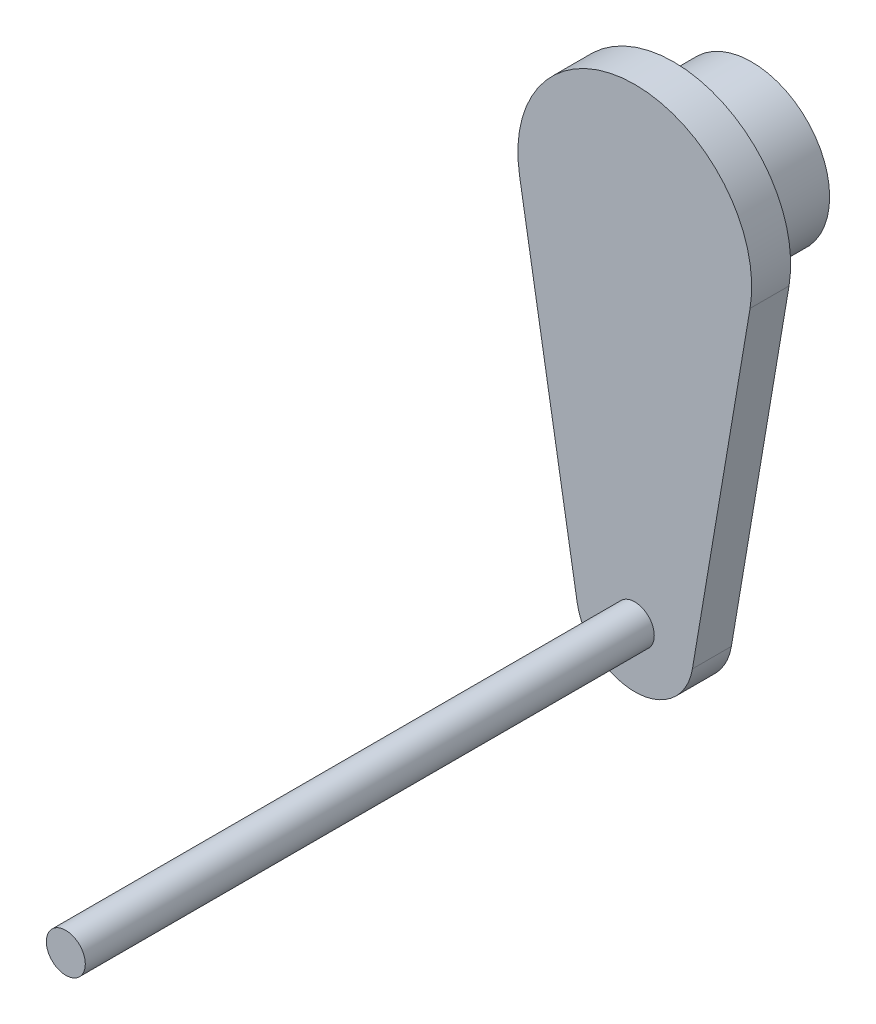
ISO-10303-21;
HEADER;
FILE_DESCRIPTION(('STEP AP214'),'2;1');
FILE_NAME('part.step','',(''),(''),'','','');
FILE_SCHEMA(('AUTOMOTIVE_DESIGN { 1 0 10303 214 1 1 1 1 }'));
ENDSEC;
DATA;
#1=APPLICATION_CONTEXT('core data for automotive mechanical design processes');
#2=APPLICATION_PROTOCOL_DEFINITION('international standard','automotive_design',2000,#1);
#3=PRODUCT_CONTEXT('',#1,'mechanical');
#4=PRODUCT('Part','Part','',(#3));
#5=PRODUCT_RELATED_PRODUCT_CATEGORY('part','',(#4));
#6=PRODUCT_DEFINITION_FORMATION('','',#4);
#7=PRODUCT_DEFINITION_CONTEXT('part definition',#1,'design');
#8=PRODUCT_DEFINITION('design','',#6,#7);
#9=PRODUCT_DEFINITION_SHAPE('','',#8);
#10=(LENGTH_UNIT() NAMED_UNIT(*) SI_UNIT(.MILLI.,.METRE.));
#11=(NAMED_UNIT(*) PLANE_ANGLE_UNIT() SI_UNIT($,.RADIAN.));
#12=(NAMED_UNIT(*) SI_UNIT($,.STERADIAN.) SOLID_ANGLE_UNIT());
#13=UNCERTAINTY_MEASURE_WITH_UNIT(LENGTH_MEASURE(1.E-05),#10,'distance_accuracy_value','');
#14=(GEOMETRIC_REPRESENTATION_CONTEXT(3) GLOBAL_UNCERTAINTY_ASSIGNED_CONTEXT((#13)) GLOBAL_UNIT_ASSIGNED_CONTEXT((#10,
#11,#12)) REPRESENTATION_CONTEXT('',''));
#15=CARTESIAN_POINT('',(0.,0.,0.));
#16=DIRECTION('',(0.,0.,1.));
#17=DIRECTION('',(1.,0.,0.));
#18=AXIS2_PLACEMENT_3D('',#15,#16,#17);
#19=CARTESIAN_POINT('',(0.,-1.22124532708767E-12,-48.6210244842766));
#20=DIRECTION('',(0.,0.,1.));
#21=DIRECTION('',(1.,0.,0.));
#22=AXIS2_PLACEMENT_3D('',#19,#20,#21);
#23=CYLINDRICAL_SURFACE('',#22,12.7);
#24=CARTESIAN_POINT('',(0.,-1.22124532708767E-12,-12.7));
#25=DIRECTION('',(0.,0.,1.));
#26=DIRECTION('',(1.,0.,0.));
#27=AXIS2_PLACEMENT_3D('',#24,#25,#26);
#28=CIRCLE('',#27,12.7);
#29=CARTESIAN_POINT('',(12.7,-1.22124532708767E-12,-12.7));
#30=VERTEX_POINT('',#29);
#31=EDGE_CURVE('E12',#30,#30,#28,.F.);
#32=ORIENTED_EDGE('',*,*,#31,.F.);
#33=EDGE_LOOP('',(#32));
#34=FACE_BOUND('',#33,.T.);
#35=CARTESIAN_POINT('',(0.,-1.22124532708767E-12,0.));
#36=DIRECTION('',(0.,0.,1.));
#37=DIRECTION('',(1.,0.,0.));
#38=AXIS2_PLACEMENT_3D('',#35,#36,#37);
#39=CIRCLE('',#38,12.7);
#40=CARTESIAN_POINT('',(12.7,-1.22124532708767E-12,0.));
#41=VERTEX_POINT('',#40);
#42=EDGE_CURVE('E45',#41,#41,#39,.T.);
#43=ORIENTED_EDGE('',*,*,#42,.F.);
#44=EDGE_LOOP('',(#43));
#45=FACE_BOUND('',#44,.T.);
#46=ADVANCED_FACE('F37',(#34,#45),#23,.T.);
#47=CARTESIAN_POINT('',(0.,-1.22124532708767E-12,-12.7));
#48=DIRECTION('',(0.,0.,1.));
#49=DIRECTION('',(1.,0.,0.));
#50=AXIS2_PLACEMENT_3D('',#47,#48,#49);
#51=PLANE('',#50);
#52=ORIENTED_EDGE('',*,*,#31,.T.);
#53=EDGE_LOOP('',(#52));
#54=FACE_BOUND('',#53,.T.);
#55=ADVANCED_FACE('F124',(#54),#51,.F.);
#56=CARTESIAN_POINT('',(-18.7835533113415,-3.17500000000003,6.35));
#57=DIRECTION('',(0.986013297183269,0.166666666666667,0.));
#58=DIRECTION('',(-0.166666666666667,0.986013297183269,0.));
#59=AXIS2_PLACEMENT_3D('',#56,#57,#58);
#60=PLANE('',#59);
#61=DIRECTION('',(0.166666666666667,-0.986013297183269,0.));
#62=VECTOR('',#61,1.);
#63=CARTESIAN_POINT('',(-18.7835533113415,-3.17500000000003,0.));
#64=LINE('',#63,#62);
#65=CARTESIAN_POINT('',(-18.7835533113413,-3.17500000000122,0.));
#66=VERTEX_POINT('',#65);
#67=CARTESIAN_POINT('',(-9.39177665567064,-58.7375000000012,0.));
#68=VERTEX_POINT('',#67);
#69=EDGE_CURVE('E107',#66,#68,#64,.T.);
#70=ORIENTED_EDGE('',*,*,#69,.T.);
#71=DIRECTION('',(0.,0.,-1.));
#72=VECTOR('',#71,1.);
#73=CARTESIAN_POINT('',(-9.39177665567064,-58.7375000000012,6.35));
#74=LINE('',#73,#72);
#75=CARTESIAN_POINT('',(-9.39177665567064,-58.7375000000012,6.35));
#76=VERTEX_POINT('',#75);
#77=EDGE_CURVE('E96',#76,#68,#74,.T.);
#78=ORIENTED_EDGE('',*,*,#77,.F.);
#79=DIRECTION('',(0.166666666666667,-0.986013297183269,0.));
#80=VECTOR('',#79,1.);
#81=CARTESIAN_POINT('',(-18.7835533113415,-3.17500000000003,6.35));
#82=LINE('',#81,#80);
#83=CARTESIAN_POINT('',(-18.7835533113413,-3.17500000000122,6.35));
#84=VERTEX_POINT('',#83);
#85=EDGE_CURVE('E86',#84,#76,#82,.T.);
#86=ORIENTED_EDGE('',*,*,#85,.F.);
#87=DIRECTION('',(0.,0.,-1.));
#88=VECTOR('',#87,1.);
#89=CARTESIAN_POINT('',(-18.7835533113413,-3.17500000000122,6.35));
#90=LINE('',#89,#88);
#91=EDGE_CURVE('E106',#84,#66,#90,.T.);
#92=ORIENTED_EDGE('',*,*,#91,.T.);
#93=EDGE_LOOP('',(#70,#78,#86,#92));
#94=FACE_BOUND('',#93,.T.);
#95=ADVANCED_FACE('F129',(#94),#60,.F.);
#96=CARTESIAN_POINT('',(0.,-57.1500000000012,6.35));
#97=DIRECTION('',(0.,0.,-1.));
#98=DIRECTION('',(-1.,0.,0.));
#99=AXIS2_PLACEMENT_3D('',#96,#97,#98);
#100=CYLINDRICAL_SURFACE('',#99,9.52500000000002);
#101=CARTESIAN_POINT('',(0.,-57.1500000000012,0.));
#102=DIRECTION('',(0.,0.,1.));
#103=DIRECTION('',(1.,0.,0.));
#104=AXIS2_PLACEMENT_3D('',#101,#102,#103);
#105=CIRCLE('',#104,9.52500000000002);
#106=CARTESIAN_POINT('',(9.39177665567064,-58.7375000000012,0.));
#107=VERTEX_POINT('',#106);
#108=EDGE_CURVE('E92',#68,#107,#105,.T.);
#109=ORIENTED_EDGE('',*,*,#108,.T.);
#110=DIRECTION('',(0.,0.,-1.));
#111=VECTOR('',#110,1.);
#112=CARTESIAN_POINT('',(9.39177665567064,-58.7375000000012,6.35));
#113=LINE('',#112,#111);
#114=CARTESIAN_POINT('',(9.39177665567064,-58.7375000000012,6.35));
#115=VERTEX_POINT('',#114);
#116=EDGE_CURVE('E90',#115,#107,#113,.T.);
#117=ORIENTED_EDGE('',*,*,#116,.F.);
#118=CARTESIAN_POINT('',(0.,-57.1500000000012,6.35));
#119=DIRECTION('',(0.,0.,1.));
#120=DIRECTION('',(1.,0.,0.));
#121=AXIS2_PLACEMENT_3D('',#118,#119,#120);
#122=CIRCLE('',#121,9.52500000000002);
#123=EDGE_CURVE('E80',#76,#115,#122,.T.);
#124=ORIENTED_EDGE('',*,*,#123,.F.);
#125=ORIENTED_EDGE('',*,*,#77,.T.);
#126=EDGE_LOOP('',(#109,#117,#124,#125));
#127=FACE_BOUND('',#126,.T.);
#128=ADVANCED_FACE('F91',(#127),#100,.T.);
#129=CARTESIAN_POINT('',(18.7835533113415,-3.17500000000003,6.35));
#130=DIRECTION('',(0.986013297183269,-0.166666666666667,0.));
#131=DIRECTION('',(0.166666666666667,0.986013297183269,0.));
#132=AXIS2_PLACEMENT_3D('',#129,#130,#131);
#133=PLANE('',#132);
#134=DIRECTION('',(-0.166666666666667,-0.986013297183269,0.));
#135=VECTOR('',#134,1.);
#136=CARTESIAN_POINT('',(18.7835533113415,-3.17500000000003,0.));
#137=LINE('',#136,#135);
#138=CARTESIAN_POINT('',(18.7835533113413,-3.17500000000122,0.));
#139=VERTEX_POINT('',#138);
#140=EDGE_CURVE('E112',#139,#107,#137,.T.);
#141=ORIENTED_EDGE('',*,*,#140,.F.);
#142=DIRECTION('',(0.,0.,-1.));
#143=VECTOR('',#142,1.);
#144=CARTESIAN_POINT('',(18.7835533113413,-3.17500000000122,6.35));
#145=LINE('',#144,#143);
#146=CARTESIAN_POINT('',(18.7835533113413,-3.17500000000122,6.35));
#147=VERTEX_POINT('',#146);
#148=EDGE_CURVE('E69',#147,#139,#145,.T.);
#149=ORIENTED_EDGE('',*,*,#148,.F.);
#150=DIRECTION('',(-0.166666666666667,-0.986013297183269,0.));
#151=VECTOR('',#150,1.);
#152=CARTESIAN_POINT('',(18.7835533113415,-3.17500000000003,6.35));
#153=LINE('',#152,#151);
#154=EDGE_CURVE('E84',#147,#115,#153,.T.);
#155=ORIENTED_EDGE('',*,*,#154,.T.);
#156=ORIENTED_EDGE('',*,*,#116,.T.);
#157=EDGE_LOOP('',(#141,#149,#155,#156));
#158=FACE_BOUND('',#157,.T.);
#159=ADVANCED_FACE('F98',(#158),#133,.T.);
#160=CARTESIAN_POINT('',(0.,-1.22124532708767E-12,6.35));
#161=DIRECTION('',(0.,0.,-1.));
#162=DIRECTION('',(-1.,0.,0.));
#163=AXIS2_PLACEMENT_3D('',#160,#161,#162);
#164=CYLINDRICAL_SURFACE('',#163,19.05);
#165=CARTESIAN_POINT('',(0.,-1.22124532708767E-12,0.));
#166=DIRECTION('',(0.,0.,1.));
#167=DIRECTION('',(1.,0.,0.));
#168=AXIS2_PLACEMENT_3D('',#165,#166,#167);
#169=CIRCLE('',#168,19.05);
#170=EDGE_CURVE('E72',#139,#66,#169,.T.);
#171=ORIENTED_EDGE('',*,*,#170,.T.);
#172=ORIENTED_EDGE('',*,*,#91,.F.);
#173=CARTESIAN_POINT('',(0.,-1.22124532708767E-12,6.35));
#174=DIRECTION('',(0.,0.,1.));
#175=DIRECTION('',(1.,0.,0.));
#176=AXIS2_PLACEMENT_3D('',#173,#174,#175);
#177=CIRCLE('',#176,19.05);
#178=EDGE_CURVE('E53',#147,#84,#177,.T.);
#179=ORIENTED_EDGE('',*,*,#178,.F.);
#180=ORIENTED_EDGE('',*,*,#148,.T.);
#181=EDGE_LOOP('',(#171,#172,#179,#180));
#182=FACE_BOUND('',#181,.T.);
#183=ADVANCED_FACE('F142',(#182),#164,.T.);
#184=CARTESIAN_POINT('',(0.,0.,6.35));
#185=DIRECTION('',(0.,0.,1.));
#186=DIRECTION('',(1.,0.,0.));
#187=AXIS2_PLACEMENT_3D('',#184,#185,#186);
#188=PLANE('',#187);
#189=ORIENTED_EDGE('',*,*,#85,.T.);
#190=ORIENTED_EDGE('',*,*,#123,.T.);
#191=ORIENTED_EDGE('',*,*,#154,.F.);
#192=ORIENTED_EDGE('',*,*,#178,.T.);
#193=EDGE_LOOP('',(#189,#190,#191,#192));
#194=FACE_BOUND('',#193,.T.);
#195=CARTESIAN_POINT('',(0.,-57.1500000000012,6.35));
#196=DIRECTION('',(0.,0.,1.));
#197=DIRECTION('',(1.,0.,0.));
#198=AXIS2_PLACEMENT_3D('',#195,#196,#197);
#199=CIRCLE('',#198,3.175);
#200=CARTESIAN_POINT('',(3.175,-57.1500000000012,6.35));
#201=VERTEX_POINT('',#200);
#202=EDGE_CURVE('E100',#201,#201,#199,.T.);
#203=ORIENTED_EDGE('',*,*,#202,.F.);
#204=EDGE_LOOP('',(#203));
#205=FACE_BOUND('',#204,.T.);
#206=ADVANCED_FACE('F81',(#194,#205),#188,.T.);
#207=CARTESIAN_POINT('',(0.,0.,0.));
#208=DIRECTION('',(0.,0.,1.));
#209=DIRECTION('',(1.,0.,0.));
#210=AXIS2_PLACEMENT_3D('',#207,#208,#209);
#211=PLANE('',#210);
#212=ORIENTED_EDGE('',*,*,#42,.T.);
#213=EDGE_LOOP('',(#212));
#214=FACE_BOUND('',#213,.T.);
#215=ORIENTED_EDGE('',*,*,#69,.F.);
#216=ORIENTED_EDGE('',*,*,#170,.F.);
#217=ORIENTED_EDGE('',*,*,#140,.T.);
#218=ORIENTED_EDGE('',*,*,#108,.F.);
#219=EDGE_LOOP('',(#215,#216,#217,#218));
#220=FACE_BOUND('',#219,.T.);
#221=ADVANCED_FACE('F120',(#214,#220),#211,.F.);
#222=CARTESIAN_POINT('',(0.,-57.1500000000012,110.580256121069));
#223=DIRECTION('',(0.,0.,-1.));
#224=DIRECTION('',(-1.,0.,0.));
#225=AXIS2_PLACEMENT_3D('',#222,#223,#224);
#226=CYLINDRICAL_SURFACE('',#225,3.175);
#227=ORIENTED_EDGE('',*,*,#202,.T.);
#228=EDGE_LOOP('',(#227));
#229=FACE_BOUND('',#228,.T.);
#230=CARTESIAN_POINT('',(0.,-57.1500000000012,99.06));
#231=DIRECTION('',(0.,0.,1.));
#232=DIRECTION('',(1.,0.,0.));
#233=AXIS2_PLACEMENT_3D('',#230,#231,#232);
#234=CIRCLE('',#233,3.175);
#235=CARTESIAN_POINT('',(3.175,-57.1500000000012,99.06));
#236=VERTEX_POINT('',#235);
#237=EDGE_CURVE('E110',#236,#236,#234,.T.);
#238=ORIENTED_EDGE('',*,*,#237,.F.);
#239=EDGE_LOOP('',(#238));
#240=FACE_BOUND('',#239,.T.);
#241=ADVANCED_FACE('F147',(#229,#240),#226,.T.);
#242=CARTESIAN_POINT('',(0.,-1.22124532708767E-12,99.06));
#243=DIRECTION('',(0.,0.,1.));
#244=DIRECTION('',(1.,0.,0.));
#245=AXIS2_PLACEMENT_3D('',#242,#243,#244);
#246=PLANE('',#245);
#247=ORIENTED_EDGE('',*,*,#237,.T.);
#248=EDGE_LOOP('',(#247));
#249=FACE_BOUND('',#248,.T.);
#250=ADVANCED_FACE('F150',(#249),#246,.T.);
#251=CLOSED_SHELL('',(#46,#55,#95,#128,#159,#183,#206,#221,#241,#250));
#252=MANIFOLD_SOLID_BREP('B2',#251);
#253=ADVANCED_BREP_SHAPE_REPRESENTATION('',(#18,#252),#14);
#254=SHAPE_DEFINITION_REPRESENTATION(#9,#253);
ENDSEC;
END-ISO-10303-21;
